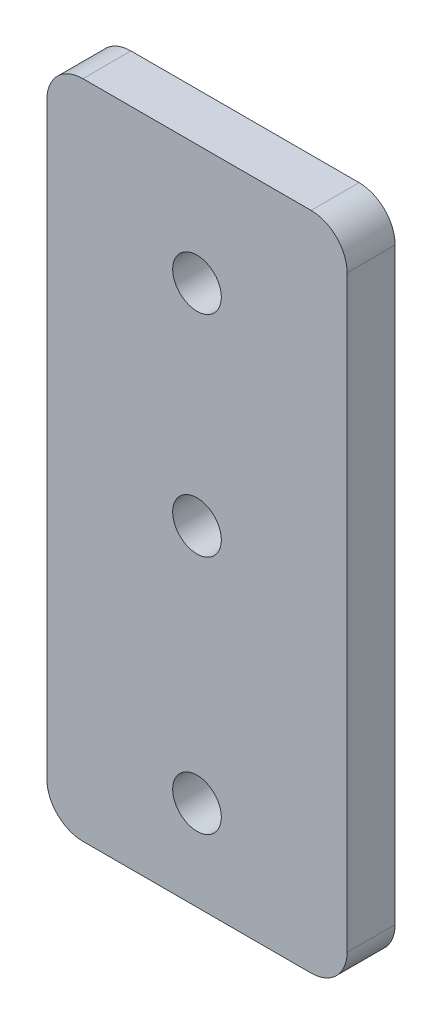
ISO-10303-21;
HEADER;
FILE_DESCRIPTION(('STEP AP214'),'2;1');
FILE_NAME('part.step','',(''),(''),'','','');
FILE_SCHEMA(('AUTOMOTIVE_DESIGN { 1 0 10303 214 1 1 1 1 }'));
ENDSEC;
DATA;
#1=APPLICATION_CONTEXT('core data for automotive mechanical design processes');
#2=APPLICATION_PROTOCOL_DEFINITION('international standard','automotive_design',2000,#1);
#3=PRODUCT_CONTEXT('',#1,'mechanical');
#4=PRODUCT('Part','Part','',(#3));
#5=PRODUCT_RELATED_PRODUCT_CATEGORY('part','',(#4));
#6=PRODUCT_DEFINITION_FORMATION('','',#4);
#7=PRODUCT_DEFINITION_CONTEXT('part definition',#1,'design');
#8=PRODUCT_DEFINITION('design','',#6,#7);
#9=PRODUCT_DEFINITION_SHAPE('','',#8);
#10=(LENGTH_UNIT() NAMED_UNIT(*) SI_UNIT(.MILLI.,.METRE.));
#11=(NAMED_UNIT(*) PLANE_ANGLE_UNIT() SI_UNIT($,.RADIAN.));
#12=(NAMED_UNIT(*) SI_UNIT($,.STERADIAN.) SOLID_ANGLE_UNIT());
#13=UNCERTAINTY_MEASURE_WITH_UNIT(LENGTH_MEASURE(1.E-05),#10,'distance_accuracy_value','');
#14=(GEOMETRIC_REPRESENTATION_CONTEXT(3) GLOBAL_UNCERTAINTY_ASSIGNED_CONTEXT((#13)) GLOBAL_UNIT_ASSIGNED_CONTEXT((#10,
#11,#12)) REPRESENTATION_CONTEXT('',''));
#15=CARTESIAN_POINT('',(0.,0.,0.));
#16=DIRECTION('',(0.,0.,1.));
#17=DIRECTION('',(1.,0.,0.));
#18=AXIS2_PLACEMENT_3D('',#15,#16,#17);
#19=CARTESIAN_POINT('',(12.5,-27.5,2.));
#20=DIRECTION('',(-1.,0.,0.));
#21=DIRECTION('',(0.,0.,1.));
#22=AXIS2_PLACEMENT_3D('',#19,#20,#21);
#23=PLANE('',#22);
#24=DIRECTION('',(0.,1.,0.));
#25=VECTOR('',#24,1.);
#26=CARTESIAN_POINT('',(12.5,-27.5,2.));
#27=LINE('',#26,#25);
#28=CARTESIAN_POINT('',(12.5,-24.5,2.));
#29=VERTEX_POINT('',#28);
#30=CARTESIAN_POINT('',(12.5,24.5,2.));
#31=VERTEX_POINT('',#30);
#32=EDGE_CURVE('E122',#29,#31,#27,.T.);
#33=ORIENTED_EDGE('',*,*,#32,.F.);
#34=DIRECTION('',(0.,0.,-1.));
#35=VECTOR('',#34,1.);
#36=CARTESIAN_POINT('',(12.5,-24.5,2.));
#37=LINE('',#36,#35);
#38=CARTESIAN_POINT('',(12.5,-24.5,-2.));
#39=VERTEX_POINT('',#38);
#40=EDGE_CURVE('E107',#29,#39,#37,.T.);
#41=ORIENTED_EDGE('',*,*,#40,.T.);
#42=DIRECTION('',(0.,1.,0.));
#43=VECTOR('',#42,1.);
#44=CARTESIAN_POINT('',(12.5,-27.5,-2.));
#45=LINE('',#44,#43);
#46=CARTESIAN_POINT('',(12.5,24.5,-2.));
#47=VERTEX_POINT('',#46);
#48=EDGE_CURVE('E119',#39,#47,#45,.T.);
#49=ORIENTED_EDGE('',*,*,#48,.T.);
#50=DIRECTION('',(0.,0.,-1.));
#51=VECTOR('',#50,1.);
#52=CARTESIAN_POINT('',(12.5,24.5,2.));
#53=LINE('',#52,#51);
#54=EDGE_CURVE('E124',#47,#31,#53,.F.);
#55=ORIENTED_EDGE('',*,*,#54,.T.);
#56=EDGE_LOOP('',(#33,#41,#49,#55));
#57=FACE_BOUND('',#56,.T.);
#58=ADVANCED_FACE('F36',(#57),#23,.F.);
#59=CARTESIAN_POINT('',(-12.5,27.5,2.));
#60=DIRECTION('',(0.,-1.,0.));
#61=DIRECTION('',(0.,0.,-1.));
#62=AXIS2_PLACEMENT_3D('',#59,#60,#61);
#63=PLANE('',#62);
#64=DIRECTION('',(-1.,0.,0.));
#65=VECTOR('',#64,1.);
#66=CARTESIAN_POINT('',(-12.5,27.5,2.));
#67=LINE('',#66,#65);
#68=CARTESIAN_POINT('',(9.5,27.5,2.));
#69=VERTEX_POINT('',#68);
#70=CARTESIAN_POINT('',(-9.5,27.5,2.));
#71=VERTEX_POINT('',#70);
#72=EDGE_CURVE('E176',#69,#71,#67,.T.);
#73=ORIENTED_EDGE('',*,*,#72,.F.);
#74=DIRECTION('',(0.,0.,-1.));
#75=VECTOR('',#74,1.);
#76=CARTESIAN_POINT('',(9.5,27.5,2.));
#77=LINE('',#76,#75);
#78=CARTESIAN_POINT('',(9.5,27.5,-2.));
#79=VERTEX_POINT('',#78);
#80=EDGE_CURVE('E11',#69,#79,#77,.T.);
#81=ORIENTED_EDGE('',*,*,#80,.T.);
#82=DIRECTION('',(-1.,0.,0.));
#83=VECTOR('',#82,1.);
#84=CARTESIAN_POINT('',(-12.5,27.5,-2.));
#85=LINE('',#84,#83);
#86=CARTESIAN_POINT('',(-9.5,27.5,-2.));
#87=VERTEX_POINT('',#86);
#88=EDGE_CURVE('E129',#79,#87,#85,.T.);
#89=ORIENTED_EDGE('',*,*,#88,.T.);
#90=DIRECTION('',(0.,0.,-1.));
#91=VECTOR('',#90,1.);
#92=CARTESIAN_POINT('',(-9.5,27.5,2.));
#93=LINE('',#92,#91);
#94=EDGE_CURVE('E44',#87,#71,#93,.F.);
#95=ORIENTED_EDGE('',*,*,#94,.T.);
#96=EDGE_LOOP('',(#73,#81,#89,#95));
#97=FACE_BOUND('',#96,.T.);
#98=ADVANCED_FACE('F175',(#97),#63,.F.);
#99=CARTESIAN_POINT('',(-12.5,-27.5,2.));
#100=DIRECTION('',(1.,0.,0.));
#101=DIRECTION('',(0.,0.,-1.));
#102=AXIS2_PLACEMENT_3D('',#99,#100,#101);
#103=PLANE('',#102);
#104=DIRECTION('',(0.,-1.,0.));
#105=VECTOR('',#104,1.);
#106=CARTESIAN_POINT('',(-12.5,-27.5,-2.));
#107=LINE('',#106,#105);
#108=CARTESIAN_POINT('',(-12.5,24.5,-2.));
#109=VERTEX_POINT('',#108);
#110=CARTESIAN_POINT('',(-12.5,-24.5,-2.));
#111=VERTEX_POINT('',#110);
#112=EDGE_CURVE('E133',#109,#111,#107,.T.);
#113=ORIENTED_EDGE('',*,*,#112,.T.);
#114=DIRECTION('',(0.,0.,-1.));
#115=VECTOR('',#114,1.);
#116=CARTESIAN_POINT('',(-12.5,-24.5,2.));
#117=LINE('',#116,#115);
#118=CARTESIAN_POINT('',(-12.5,-24.5,2.));
#119=VERTEX_POINT('',#118);
#120=EDGE_CURVE('E51',#111,#119,#117,.F.);
#121=ORIENTED_EDGE('',*,*,#120,.T.);
#122=DIRECTION('',(0.,-1.,0.));
#123=VECTOR('',#122,1.);
#124=CARTESIAN_POINT('',(-12.5,-27.5,2.));
#125=LINE('',#124,#123);
#126=CARTESIAN_POINT('',(-12.5,24.5,2.));
#127=VERTEX_POINT('',#126);
#128=EDGE_CURVE('E182',#127,#119,#125,.T.);
#129=ORIENTED_EDGE('',*,*,#128,.F.);
#130=DIRECTION('',(0.,0.,-1.));
#131=VECTOR('',#130,1.);
#132=CARTESIAN_POINT('',(-12.5,24.5,2.));
#133=LINE('',#132,#131);
#134=EDGE_CURVE('E169',#127,#109,#133,.T.);
#135=ORIENTED_EDGE('',*,*,#134,.T.);
#136=EDGE_LOOP('',(#113,#121,#129,#135));
#137=FACE_BOUND('',#136,.T.);
#138=ADVANCED_FACE('F186',(#137),#103,.F.);
#139=CARTESIAN_POINT('',(-12.5,-27.5,2.));
#140=DIRECTION('',(0.,1.,0.));
#141=DIRECTION('',(0.,0.,1.));
#142=AXIS2_PLACEMENT_3D('',#139,#140,#141);
#143=PLANE('',#142);
#144=DIRECTION('',(1.,0.,0.));
#145=VECTOR('',#144,1.);
#146=CARTESIAN_POINT('',(-12.5,-27.5,-2.));
#147=LINE('',#146,#145);
#148=CARTESIAN_POINT('',(-9.5,-27.5,-2.));
#149=VERTEX_POINT('',#148);
#150=CARTESIAN_POINT('',(9.5,-27.5,-2.));
#151=VERTEX_POINT('',#150);
#152=EDGE_CURVE('E143',#149,#151,#147,.T.);
#153=ORIENTED_EDGE('',*,*,#152,.T.);
#154=DIRECTION('',(0.,0.,-1.));
#155=VECTOR('',#154,1.);
#156=CARTESIAN_POINT('',(9.5,-27.5,2.));
#157=LINE('',#156,#155);
#158=CARTESIAN_POINT('',(9.5,-27.5,2.));
#159=VERTEX_POINT('',#158);
#160=EDGE_CURVE('E108',#151,#159,#157,.F.);
#161=ORIENTED_EDGE('',*,*,#160,.T.);
#162=DIRECTION('',(1.,0.,0.));
#163=VECTOR('',#162,1.);
#164=CARTESIAN_POINT('',(-12.5,-27.5,2.));
#165=LINE('',#164,#163);
#166=CARTESIAN_POINT('',(-9.5,-27.5,2.));
#167=VERTEX_POINT('',#166);
#168=EDGE_CURVE('E139',#167,#159,#165,.T.);
#169=ORIENTED_EDGE('',*,*,#168,.F.);
#170=DIRECTION('',(0.,0.,-1.));
#171=VECTOR('',#170,1.);
#172=CARTESIAN_POINT('',(-9.5,-27.5,2.));
#173=LINE('',#172,#171);
#174=EDGE_CURVE('E113',#167,#149,#173,.T.);
#175=ORIENTED_EDGE('',*,*,#174,.T.);
#176=EDGE_LOOP('',(#153,#161,#169,#175));
#177=FACE_BOUND('',#176,.T.);
#178=ADVANCED_FACE('F193',(#177),#143,.F.);
#179=CARTESIAN_POINT('',(0.,0.,2.));
#180=DIRECTION('',(0.,0.,-1.));
#181=DIRECTION('',(-1.,0.,0.));
#182=AXIS2_PLACEMENT_3D('',#179,#180,#181);
#183=PLANE('',#182);
#184=CARTESIAN_POINT('',(0.,17.5,2.));
#185=DIRECTION('',(0.,0.,-1.));
#186=DIRECTION('',(-1.,0.,0.));
#187=AXIS2_PLACEMENT_3D('',#184,#185,#186);
#188=CIRCLE('',#187,2.025);
#189=CARTESIAN_POINT('',(-2.025,17.5,2.));
#190=VERTEX_POINT('',#189);
#191=EDGE_CURVE('E130',#190,#190,#188,.T.);
#192=ORIENTED_EDGE('',*,*,#191,.T.);
#193=EDGE_LOOP('',(#192));
#194=FACE_BOUND('',#193,.T.);
#195=CARTESIAN_POINT('',(0.,0.,2.));
#196=DIRECTION('',(0.,0.,-1.));
#197=DIRECTION('',(-1.,0.,0.));
#198=AXIS2_PLACEMENT_3D('',#195,#196,#197);
#199=CIRCLE('',#198,2.025);
#200=CARTESIAN_POINT('',(-2.025,0.,2.));
#201=VERTEX_POINT('',#200);
#202=EDGE_CURVE('E152',#201,#201,#199,.T.);
#203=ORIENTED_EDGE('',*,*,#202,.T.);
#204=EDGE_LOOP('',(#203));
#205=FACE_BOUND('',#204,.T.);
#206=CARTESIAN_POINT('',(0.,-20.,2.));
#207=DIRECTION('',(0.,0.,-1.));
#208=DIRECTION('',(-1.,0.,0.));
#209=AXIS2_PLACEMENT_3D('',#206,#207,#208);
#210=CIRCLE('',#209,2.025);
#211=CARTESIAN_POINT('',(-2.025,-20.,2.));
#212=VERTEX_POINT('',#211);
#213=EDGE_CURVE('E148',#212,#212,#210,.T.);
#214=ORIENTED_EDGE('',*,*,#213,.T.);
#215=EDGE_LOOP('',(#214));
#216=FACE_BOUND('',#215,.T.);
#217=ORIENTED_EDGE('',*,*,#168,.T.);
#218=CARTESIAN_POINT('',(9.5,-24.5,2.));
#219=DIRECTION('',(0.,0.,-1.));
#220=DIRECTION('',(-1.,0.,0.));
#221=AXIS2_PLACEMENT_3D('',#218,#219,#220);
#222=CIRCLE('',#221,3.);
#223=EDGE_CURVE('E167',#159,#29,#222,.F.);
#224=ORIENTED_EDGE('',*,*,#223,.T.);
#225=ORIENTED_EDGE('',*,*,#32,.T.);
#226=CARTESIAN_POINT('',(9.5,24.5,2.));
#227=DIRECTION('',(0.,0.,-1.));
#228=DIRECTION('',(-1.,0.,0.));
#229=AXIS2_PLACEMENT_3D('',#226,#227,#228);
#230=CIRCLE('',#229,3.);
#231=EDGE_CURVE('E163',#31,#69,#230,.F.);
#232=ORIENTED_EDGE('',*,*,#231,.T.);
#233=ORIENTED_EDGE('',*,*,#72,.T.);
#234=CARTESIAN_POINT('',(-9.5,24.5,2.));
#235=DIRECTION('',(0.,0.,-1.));
#236=DIRECTION('',(-1.,0.,0.));
#237=AXIS2_PLACEMENT_3D('',#234,#235,#236);
#238=CIRCLE('',#237,3.);
#239=EDGE_CURVE('E58',#71,#127,#238,.F.);
#240=ORIENTED_EDGE('',*,*,#239,.T.);
#241=ORIENTED_EDGE('',*,*,#128,.T.);
#242=CARTESIAN_POINT('',(-9.5,-24.5,2.));
#243=DIRECTION('',(0.,0.,-1.));
#244=DIRECTION('',(-1.,0.,0.));
#245=AXIS2_PLACEMENT_3D('',#242,#243,#244);
#246=CIRCLE('',#245,3.);
#247=EDGE_CURVE('E165',#119,#167,#246,.F.);
#248=ORIENTED_EDGE('',*,*,#247,.T.);
#249=EDGE_LOOP('',(#217,#224,#225,#232,#233,#240,#241,#248));
#250=FACE_BOUND('',#249,.T.);
#251=ADVANCED_FACE('F180',(#194,#205,#216,#250),#183,.F.);
#252=CARTESIAN_POINT('',(0.,0.,-2.));
#253=DIRECTION('',(0.,0.,-1.));
#254=DIRECTION('',(-1.,0.,0.));
#255=AXIS2_PLACEMENT_3D('',#252,#253,#254);
#256=PLANE('',#255);
#257=CARTESIAN_POINT('',(0.,17.5,-2.));
#258=DIRECTION('',(0.,0.,-1.));
#259=DIRECTION('',(-1.,0.,0.));
#260=AXIS2_PLACEMENT_3D('',#257,#258,#259);
#261=CIRCLE('',#260,2.025);
#262=CARTESIAN_POINT('',(-2.025,17.5,-2.));
#263=VERTEX_POINT('',#262);
#264=EDGE_CURVE('E136',#263,#263,#261,.T.);
#265=ORIENTED_EDGE('',*,*,#264,.F.);
#266=EDGE_LOOP('',(#265));
#267=FACE_BOUND('',#266,.T.);
#268=CARTESIAN_POINT('',(0.,0.,-2.));
#269=DIRECTION('',(0.,0.,-1.));
#270=DIRECTION('',(-1.,0.,0.));
#271=AXIS2_PLACEMENT_3D('',#268,#269,#270);
#272=CIRCLE('',#271,2.025);
#273=CARTESIAN_POINT('',(-2.025,0.,-2.));
#274=VERTEX_POINT('',#273);
#275=EDGE_CURVE('E149',#274,#274,#272,.T.);
#276=ORIENTED_EDGE('',*,*,#275,.F.);
#277=EDGE_LOOP('',(#276));
#278=FACE_BOUND('',#277,.T.);
#279=CARTESIAN_POINT('',(0.,-20.,-2.));
#280=DIRECTION('',(0.,0.,-1.));
#281=DIRECTION('',(-1.,0.,0.));
#282=AXIS2_PLACEMENT_3D('',#279,#280,#281);
#283=CIRCLE('',#282,2.025);
#284=CARTESIAN_POINT('',(-2.025,-20.,-2.));
#285=VERTEX_POINT('',#284);
#286=EDGE_CURVE('E145',#285,#285,#283,.T.);
#287=ORIENTED_EDGE('',*,*,#286,.F.);
#288=EDGE_LOOP('',(#287));
#289=FACE_BOUND('',#288,.T.);
#290=ORIENTED_EDGE('',*,*,#48,.F.);
#291=CARTESIAN_POINT('',(9.5,-24.5,-2.));
#292=DIRECTION('',(0.,0.,-1.));
#293=DIRECTION('',(-1.,0.,0.));
#294=AXIS2_PLACEMENT_3D('',#291,#292,#293);
#295=CIRCLE('',#294,3.);
#296=EDGE_CURVE('E103',#39,#151,#295,.T.);
#297=ORIENTED_EDGE('',*,*,#296,.T.);
#298=ORIENTED_EDGE('',*,*,#152,.F.);
#299=CARTESIAN_POINT('',(-9.5,-24.5,-2.));
#300=DIRECTION('',(0.,0.,-1.));
#301=DIRECTION('',(-1.,0.,0.));
#302=AXIS2_PLACEMENT_3D('',#299,#300,#301);
#303=CIRCLE('',#302,3.);
#304=EDGE_CURVE('E114',#149,#111,#303,.T.);
#305=ORIENTED_EDGE('',*,*,#304,.T.);
#306=ORIENTED_EDGE('',*,*,#112,.F.);
#307=CARTESIAN_POINT('',(-9.5,24.5,-2.));
#308=DIRECTION('',(0.,0.,-1.));
#309=DIRECTION('',(-1.,0.,0.));
#310=AXIS2_PLACEMENT_3D('',#307,#308,#309);
#311=CIRCLE('',#310,3.);
#312=EDGE_CURVE('E123',#109,#87,#311,.T.);
#313=ORIENTED_EDGE('',*,*,#312,.T.);
#314=ORIENTED_EDGE('',*,*,#88,.F.);
#315=CARTESIAN_POINT('',(9.5,24.5,-2.));
#316=DIRECTION('',(0.,0.,-1.));
#317=DIRECTION('',(-1.,0.,0.));
#318=AXIS2_PLACEMENT_3D('',#315,#316,#317);
#319=CIRCLE('',#318,3.);
#320=EDGE_CURVE('E128',#79,#47,#319,.T.);
#321=ORIENTED_EDGE('',*,*,#320,.T.);
#322=EDGE_LOOP('',(#290,#297,#298,#305,#306,#313,#314,#321));
#323=FACE_BOUND('',#322,.T.);
#324=ADVANCED_FACE('F126',(#267,#278,#289,#323),#256,.T.);
#325=CARTESIAN_POINT('',(0.,-20.,-10.));
#326=DIRECTION('',(0.,0.,1.));
#327=DIRECTION('',(1.,0.,0.));
#328=AXIS2_PLACEMENT_3D('',#325,#326,#327);
#329=CYLINDRICAL_SURFACE('',#328,2.025);
#330=ORIENTED_EDGE('',*,*,#286,.T.);
#331=EDGE_LOOP('',(#330));
#332=FACE_BOUND('',#331,.T.);
#333=ORIENTED_EDGE('',*,*,#213,.F.);
#334=EDGE_LOOP('',(#333));
#335=FACE_BOUND('',#334,.T.);
#336=ADVANCED_FACE('F202',(#332,#335),#329,.F.);
#337=CARTESIAN_POINT('',(0.,0.,-10.));
#338=DIRECTION('',(0.,0.,1.));
#339=DIRECTION('',(1.,0.,0.));
#340=AXIS2_PLACEMENT_3D('',#337,#338,#339);
#341=CYLINDRICAL_SURFACE('',#340,2.025);
#342=ORIENTED_EDGE('',*,*,#275,.T.);
#343=EDGE_LOOP('',(#342));
#344=FACE_BOUND('',#343,.T.);
#345=ORIENTED_EDGE('',*,*,#202,.F.);
#346=EDGE_LOOP('',(#345));
#347=FACE_BOUND('',#346,.T.);
#348=ADVANCED_FACE('F204',(#344,#347),#341,.F.);
#349=CARTESIAN_POINT('',(0.,17.5,-10.));
#350=DIRECTION('',(0.,0.,1.));
#351=DIRECTION('',(1.,0.,0.));
#352=AXIS2_PLACEMENT_3D('',#349,#350,#351);
#353=CYLINDRICAL_SURFACE('',#352,2.025);
#354=ORIENTED_EDGE('',*,*,#264,.T.);
#355=EDGE_LOOP('',(#354));
#356=FACE_BOUND('',#355,.T.);
#357=ORIENTED_EDGE('',*,*,#191,.F.);
#358=EDGE_LOOP('',(#357));
#359=FACE_BOUND('',#358,.T.);
#360=ADVANCED_FACE('F211',(#356,#359),#353,.F.);
#361=CARTESIAN_POINT('',(9.5,-24.5,2.));
#362=DIRECTION('',(0.,0.,-1.));
#363=DIRECTION('',(-1.,0.,0.));
#364=AXIS2_PLACEMENT_3D('',#361,#362,#363);
#365=CYLINDRICAL_SURFACE('',#364,3.);
#366=ORIENTED_EDGE('',*,*,#223,.F.);
#367=ORIENTED_EDGE('',*,*,#160,.F.);
#368=ORIENTED_EDGE('',*,*,#296,.F.);
#369=ORIENTED_EDGE('',*,*,#40,.F.);
#370=EDGE_LOOP('',(#366,#367,#368,#369));
#371=FACE_BOUND('',#370,.T.);
#372=ADVANCED_FACE('F106',(#371),#365,.T.);
#373=CARTESIAN_POINT('',(-9.5,-24.5,2.));
#374=DIRECTION('',(0.,0.,-1.));
#375=DIRECTION('',(-1.,0.,0.));
#376=AXIS2_PLACEMENT_3D('',#373,#374,#375);
#377=CYLINDRICAL_SURFACE('',#376,3.);
#378=ORIENTED_EDGE('',*,*,#247,.F.);
#379=ORIENTED_EDGE('',*,*,#120,.F.);
#380=ORIENTED_EDGE('',*,*,#304,.F.);
#381=ORIENTED_EDGE('',*,*,#174,.F.);
#382=EDGE_LOOP('',(#378,#379,#380,#381));
#383=FACE_BOUND('',#382,.T.);
#384=ADVANCED_FACE('F190',(#383),#377,.T.);
#385=CARTESIAN_POINT('',(9.5,24.5,2.));
#386=DIRECTION('',(0.,0.,-1.));
#387=DIRECTION('',(-1.,0.,0.));
#388=AXIS2_PLACEMENT_3D('',#385,#386,#387);
#389=CYLINDRICAL_SURFACE('',#388,3.);
#390=ORIENTED_EDGE('',*,*,#231,.F.);
#391=ORIENTED_EDGE('',*,*,#54,.F.);
#392=ORIENTED_EDGE('',*,*,#320,.F.);
#393=ORIENTED_EDGE('',*,*,#80,.F.);
#394=EDGE_LOOP('',(#390,#391,#392,#393));
#395=FACE_BOUND('',#394,.T.);
#396=ADVANCED_FACE('F228',(#395),#389,.T.);
#397=CARTESIAN_POINT('',(-9.5,24.5,2.));
#398=DIRECTION('',(0.,0.,-1.));
#399=DIRECTION('',(-1.,0.,0.));
#400=AXIS2_PLACEMENT_3D('',#397,#398,#399);
#401=CYLINDRICAL_SURFACE('',#400,3.);
#402=ORIENTED_EDGE('',*,*,#239,.F.);
#403=ORIENTED_EDGE('',*,*,#94,.F.);
#404=ORIENTED_EDGE('',*,*,#312,.F.);
#405=ORIENTED_EDGE('',*,*,#134,.F.);
#406=EDGE_LOOP('',(#402,#403,#404,#405));
#407=FACE_BOUND('',#406,.T.);
#408=ADVANCED_FACE('F38',(#407),#401,.T.);
#409=CLOSED_SHELL('',(#58,#98,#138,#178,#251,#324,#336,#348,#360,#372,#384,#396,#408));
#410=MANIFOLD_SOLID_BREP('B2',#409);
#411=ADVANCED_BREP_SHAPE_REPRESENTATION('',(#18,#410),#14);
#412=SHAPE_DEFINITION_REPRESENTATION(#9,#411);
ENDSEC;
END-ISO-10303-21;
